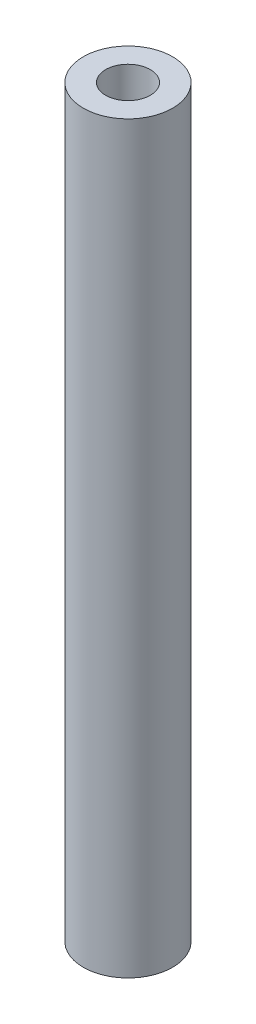
ISO-10303-21;
HEADER;
FILE_DESCRIPTION(('STEP AP214'),'2;1');
FILE_NAME('part.step','',(''),(''),'','','');
FILE_SCHEMA(('AUTOMOTIVE_DESIGN { 1 0 10303 214 1 1 1 1 }'));
ENDSEC;
DATA;
#1=APPLICATION_CONTEXT('core data for automotive mechanical design processes');
#2=APPLICATION_PROTOCOL_DEFINITION('international standard','automotive_design',2000,#1);
#3=PRODUCT_CONTEXT('',#1,'mechanical');
#4=PRODUCT('Part','Part','',(#3));
#5=PRODUCT_RELATED_PRODUCT_CATEGORY('part','',(#4));
#6=PRODUCT_DEFINITION_FORMATION('','',#4);
#7=PRODUCT_DEFINITION_CONTEXT('part definition',#1,'design');
#8=PRODUCT_DEFINITION('design','',#6,#7);
#9=PRODUCT_DEFINITION_SHAPE('','',#8);
#10=(LENGTH_UNIT() NAMED_UNIT(*) SI_UNIT(.MILLI.,.METRE.));
#11=(NAMED_UNIT(*) PLANE_ANGLE_UNIT() SI_UNIT($,.RADIAN.));
#12=(NAMED_UNIT(*) SI_UNIT($,.STERADIAN.) SOLID_ANGLE_UNIT());
#13=UNCERTAINTY_MEASURE_WITH_UNIT(LENGTH_MEASURE(1.E-05),#10,'distance_accuracy_value','');
#14=(GEOMETRIC_REPRESENTATION_CONTEXT(3) GLOBAL_UNCERTAINTY_ASSIGNED_CONTEXT((#13)) GLOBAL_UNIT_ASSIGNED_CONTEXT((#10,
#11,#12)) REPRESENTATION_CONTEXT('',''));
#15=CARTESIAN_POINT('',(0.,0.,0.));
#16=DIRECTION('',(0.,0.,1.));
#17=DIRECTION('',(1.,0.,0.));
#18=AXIS2_PLACEMENT_3D('',#15,#16,#17);
#19=CARTESIAN_POINT('',(0.,100.,0.));
#20=DIRECTION('',(0.,-1.,0.));
#21=DIRECTION('',(0.,0.,-1.));
#22=AXIS2_PLACEMENT_3D('',#19,#20,#21);
#23=CYLINDRICAL_SURFACE('',#22,1.5);
#24=CARTESIAN_POINT('',(0.,95.,0.));
#25=DIRECTION('',(0.,1.,0.));
#26=DIRECTION('',(0.,0.,1.));
#27=AXIS2_PLACEMENT_3D('',#24,#25,#26);
#28=CIRCLE('',#27,1.5);
#29=CARTESIAN_POINT('',(0.,95.,1.5));
#30=VERTEX_POINT('',#29);
#31=EDGE_CURVE('E52',#30,#30,#28,.T.);
#32=ORIENTED_EDGE('',*,*,#31,.T.);
#33=EDGE_LOOP('',(#32));
#34=FACE_BOUND('',#33,.T.);
#35=CARTESIAN_POINT('',(0.,5.,0.));
#36=DIRECTION('',(0.,-1.,0.));
#37=DIRECTION('',(0.,0.,-1.));
#38=AXIS2_PLACEMENT_3D('',#35,#36,#37);
#39=CIRCLE('',#38,1.5);
#40=CARTESIAN_POINT('',(0.,5.,-1.5));
#41=VERTEX_POINT('',#40);
#42=EDGE_CURVE('E41',#41,#41,#39,.T.);
#43=ORIENTED_EDGE('',*,*,#42,.T.);
#44=EDGE_LOOP('',(#43));
#45=FACE_BOUND('',#44,.T.);
#46=ADVANCED_FACE('F37',(#34,#45),#23,.F.);
#47=CARTESIAN_POINT('',(0.,100.,0.));
#48=DIRECTION('',(0.,1.,0.));
#49=DIRECTION('',(0.,0.,1.));
#50=AXIS2_PLACEMENT_3D('',#47,#48,#49);
#51=PLANE('',#50);
#52=CARTESIAN_POINT('',(0.,100.,0.));
#53=DIRECTION('',(0.,1.,0.));
#54=DIRECTION('',(0.,0.,1.));
#55=AXIS2_PLACEMENT_3D('',#52,#53,#54);
#56=CIRCLE('',#55,3.);
#57=CARTESIAN_POINT('',(0.,100.,3.));
#58=VERTEX_POINT('',#57);
#59=EDGE_CURVE('E55',#58,#58,#56,.T.);
#60=ORIENTED_EDGE('',*,*,#59,.F.);
#61=EDGE_LOOP('',(#60));
#62=FACE_BOUND('',#61,.T.);
#63=CARTESIAN_POINT('',(0.,100.,0.));
#64=DIRECTION('',(0.,1.,0.));
#65=DIRECTION('',(0.,0.,1.));
#66=AXIS2_PLACEMENT_3D('',#63,#64,#65);
#67=CIRCLE('',#66,6.);
#68=CARTESIAN_POINT('',(0.,100.,6.));
#69=VERTEX_POINT('',#68);
#70=EDGE_CURVE('E10',#69,#69,#67,.T.);
#71=ORIENTED_EDGE('',*,*,#70,.T.);
#72=EDGE_LOOP('',(#71));
#73=FACE_BOUND('',#72,.T.);
#74=ADVANCED_FACE('F94',(#62,#73),#51,.T.);
#75=CARTESIAN_POINT('',(0.,0.,0.));
#76=DIRECTION('',(0.,1.,0.));
#77=DIRECTION('',(0.,0.,1.));
#78=AXIS2_PLACEMENT_3D('',#75,#76,#77);
#79=PLANE('',#78);
#80=CARTESIAN_POINT('',(0.,0.,0.));
#81=DIRECTION('',(0.,-1.,0.));
#82=DIRECTION('',(0.,0.,-1.));
#83=AXIS2_PLACEMENT_3D('',#80,#81,#82);
#84=CIRCLE('',#83,3.);
#85=CARTESIAN_POINT('',(0.,0.,-3.));
#86=VERTEX_POINT('',#85);
#87=EDGE_CURVE('E69',#86,#86,#84,.T.);
#88=ORIENTED_EDGE('',*,*,#87,.F.);
#89=EDGE_LOOP('',(#88));
#90=FACE_BOUND('',#89,.T.);
#91=CARTESIAN_POINT('',(0.,0.,0.));
#92=DIRECTION('',(0.,1.,0.));
#93=DIRECTION('',(0.,0.,1.));
#94=AXIS2_PLACEMENT_3D('',#91,#92,#93);
#95=CIRCLE('',#94,6.);
#96=CARTESIAN_POINT('',(0.,0.,6.));
#97=VERTEX_POINT('',#96);
#98=EDGE_CURVE('E46',#97,#97,#95,.T.);
#99=ORIENTED_EDGE('',*,*,#98,.F.);
#100=EDGE_LOOP('',(#99));
#101=FACE_BOUND('',#100,.T.);
#102=ADVANCED_FACE('F99',(#90,#101),#79,.F.);
#103=CARTESIAN_POINT('',(0.,100.,0.));
#104=DIRECTION('',(0.,-1.,0.));
#105=DIRECTION('',(0.,0.,-1.));
#106=AXIS2_PLACEMENT_3D('',#103,#104,#105);
#107=CYLINDRICAL_SURFACE('',#106,6.);
#108=ORIENTED_EDGE('',*,*,#70,.F.);
#109=EDGE_LOOP('',(#108));
#110=FACE_BOUND('',#109,.T.);
#111=ORIENTED_EDGE('',*,*,#98,.T.);
#112=EDGE_LOOP('',(#111));
#113=FACE_BOUND('',#112,.T.);
#114=ADVANCED_FACE('F39',(#110,#113),#107,.T.);
#115=CARTESIAN_POINT('',(0.,95.,0.));
#116=DIRECTION('',(0.,1.,0.));
#117=DIRECTION('',(0.,0.,1.));
#118=AXIS2_PLACEMENT_3D('',#115,#116,#117);
#119=CYLINDRICAL_SURFACE('',#118,3.);
#120=CARTESIAN_POINT('',(0.,95.,0.));
#121=DIRECTION('',(0.,1.,0.));
#122=DIRECTION('',(0.,0.,1.));
#123=AXIS2_PLACEMENT_3D('',#120,#121,#122);
#124=CIRCLE('',#123,3.);
#125=CARTESIAN_POINT('',(0.,95.,3.));
#126=VERTEX_POINT('',#125);
#127=EDGE_CURVE('E59',#126,#126,#124,.T.);
#128=ORIENTED_EDGE('',*,*,#127,.F.);
#129=EDGE_LOOP('',(#128));
#130=FACE_BOUND('',#129,.T.);
#131=ORIENTED_EDGE('',*,*,#59,.T.);
#132=EDGE_LOOP('',(#131));
#133=FACE_BOUND('',#132,.T.);
#134=ADVANCED_FACE('F103',(#130,#133),#119,.F.);
#135=CARTESIAN_POINT('',(0.,95.,0.));
#136=DIRECTION('',(0.,1.,0.));
#137=DIRECTION('',(0.,0.,1.));
#138=AXIS2_PLACEMENT_3D('',#135,#136,#137);
#139=PLANE('',#138);
#140=ORIENTED_EDGE('',*,*,#31,.F.);
#141=EDGE_LOOP('',(#140));
#142=FACE_BOUND('',#141,.T.);
#143=ORIENTED_EDGE('',*,*,#127,.T.);
#144=EDGE_LOOP('',(#143));
#145=FACE_BOUND('',#144,.T.);
#146=ADVANCED_FACE('F90',(#142,#145),#139,.T.);
#147=CARTESIAN_POINT('',(0.,5.,0.));
#148=DIRECTION('',(0.,-1.,0.));
#149=DIRECTION('',(0.,0.,-1.));
#150=AXIS2_PLACEMENT_3D('',#147,#148,#149);
#151=CYLINDRICAL_SURFACE('',#150,3.);
#152=CARTESIAN_POINT('',(0.,5.,0.));
#153=DIRECTION('',(0.,-1.,0.));
#154=DIRECTION('',(0.,0.,-1.));
#155=AXIS2_PLACEMENT_3D('',#152,#153,#154);
#156=CIRCLE('',#155,3.);
#157=CARTESIAN_POINT('',(0.,5.,-3.));
#158=VERTEX_POINT('',#157);
#159=EDGE_CURVE('E73',#158,#158,#156,.T.);
#160=ORIENTED_EDGE('',*,*,#159,.F.);
#161=EDGE_LOOP('',(#160));
#162=FACE_BOUND('',#161,.T.);
#163=ORIENTED_EDGE('',*,*,#87,.T.);
#164=EDGE_LOOP('',(#163));
#165=FACE_BOUND('',#164,.T.);
#166=ADVANCED_FACE('F85',(#162,#165),#151,.F.);
#167=CARTESIAN_POINT('',(0.,5.,0.));
#168=DIRECTION('',(0.,-1.,0.));
#169=DIRECTION('',(0.,0.,-1.));
#170=AXIS2_PLACEMENT_3D('',#167,#168,#169);
#171=PLANE('',#170);
#172=ORIENTED_EDGE('',*,*,#42,.F.);
#173=EDGE_LOOP('',(#172));
#174=FACE_BOUND('',#173,.T.);
#175=ORIENTED_EDGE('',*,*,#159,.T.);
#176=EDGE_LOOP('',(#175));
#177=FACE_BOUND('',#176,.T.);
#178=ADVANCED_FACE('F83',(#174,#177),#171,.T.);
#179=CLOSED_SHELL('',(#46,#74,#102,#114,#134,#146,#166,#178));
#180=MANIFOLD_SOLID_BREP('B2',#179);
#181=ADVANCED_BREP_SHAPE_REPRESENTATION('',(#18,#180),#14);
#182=SHAPE_DEFINITION_REPRESENTATION(#9,#181);
ENDSEC;
END-ISO-10303-21;
